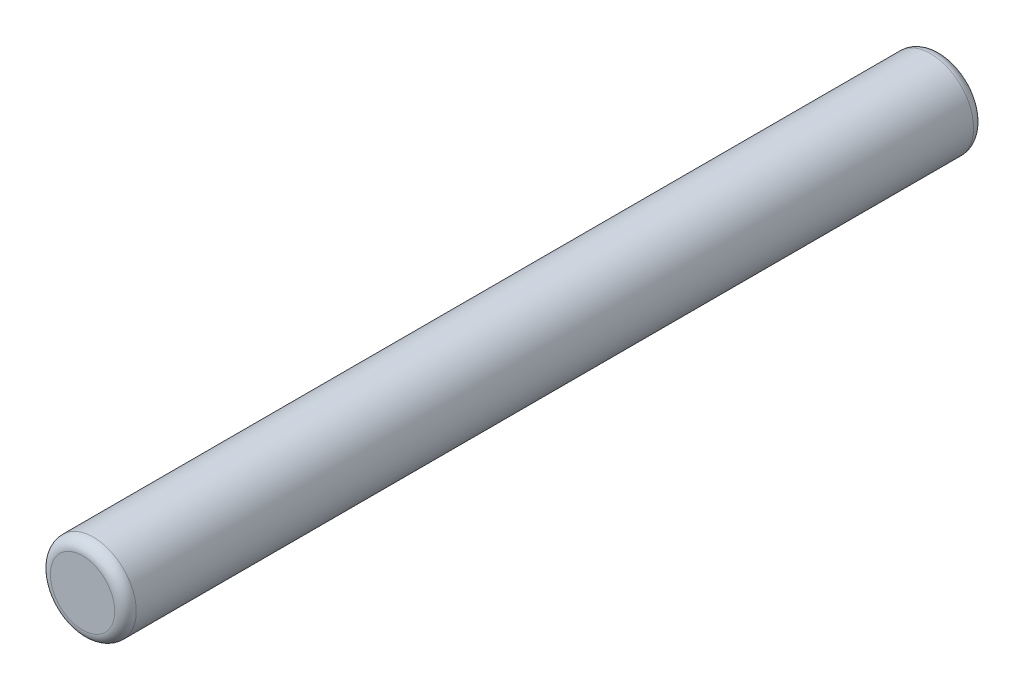
ISO-10303-21;
HEADER;
FILE_DESCRIPTION(('STEP AP214'),'2;1');
FILE_NAME('part.step','',(''),(''),'','','');
FILE_SCHEMA(('AUTOMOTIVE_DESIGN { 1 0 10303 214 1 1 1 1 }'));
ENDSEC;
DATA;
#1=APPLICATION_CONTEXT('core data for automotive mechanical design processes');
#2=APPLICATION_PROTOCOL_DEFINITION('international standard','automotive_design',2000,#1);
#3=PRODUCT_CONTEXT('',#1,'mechanical');
#4=PRODUCT('Part','Part','',(#3));
#5=PRODUCT_RELATED_PRODUCT_CATEGORY('part','',(#4));
#6=PRODUCT_DEFINITION_FORMATION('','',#4);
#7=PRODUCT_DEFINITION_CONTEXT('part definition',#1,'design');
#8=PRODUCT_DEFINITION('design','',#6,#7);
#9=PRODUCT_DEFINITION_SHAPE('','',#8);
#10=(LENGTH_UNIT() NAMED_UNIT(*) SI_UNIT(.MILLI.,.METRE.));
#11=(NAMED_UNIT(*) PLANE_ANGLE_UNIT() SI_UNIT($,.RADIAN.));
#12=(NAMED_UNIT(*) SI_UNIT($,.STERADIAN.) SOLID_ANGLE_UNIT());
#13=UNCERTAINTY_MEASURE_WITH_UNIT(LENGTH_MEASURE(1.E-05),#10,'distance_accuracy_value','');
#14=(GEOMETRIC_REPRESENTATION_CONTEXT(3) GLOBAL_UNCERTAINTY_ASSIGNED_CONTEXT((#13)) GLOBAL_UNIT_ASSIGNED_CONTEXT((#10,
#11,#12)) REPRESENTATION_CONTEXT('',''));
#15=CARTESIAN_POINT('',(0.,0.,0.));
#16=DIRECTION('',(0.,0.,1.));
#17=DIRECTION('',(1.,0.,0.));
#18=AXIS2_PLACEMENT_3D('',#15,#16,#17);
#19=CARTESIAN_POINT('',(0.,0.,40.));
#20=DIRECTION('',(0.,0.,-1.));
#21=DIRECTION('',(-1.,0.,0.));
#22=AXIS2_PLACEMENT_3D('',#19,#20,#21);
#23=CYLINDRICAL_SURFACE('',#22,2.);
#24=CARTESIAN_POINT('',(0.,0.,39.5));
#25=DIRECTION('',(0.,0.,1.));
#26=DIRECTION('',(1.,0.,0.));
#27=AXIS2_PLACEMENT_3D('',#24,#25,#26);
#28=CIRCLE('',#27,2.);
#29=CARTESIAN_POINT('',(2.,0.,39.5));
#30=VERTEX_POINT('',#29);
#31=EDGE_CURVE('E37',#30,#30,#28,.F.);
#32=ORIENTED_EDGE('',*,*,#31,.T.);
#33=EDGE_LOOP('',(#32));
#34=FACE_BOUND('',#33,.T.);
#35=CARTESIAN_POINT('',(0.,0.,0.5));
#36=DIRECTION('',(0.,0.,1.));
#37=DIRECTION('',(1.,0.,0.));
#38=AXIS2_PLACEMENT_3D('',#35,#36,#37);
#39=CIRCLE('',#38,2.);
#40=CARTESIAN_POINT('',(2.,0.,0.5));
#41=VERTEX_POINT('',#40);
#42=EDGE_CURVE('E41',#41,#41,#39,.T.);
#43=ORIENTED_EDGE('',*,*,#42,.T.);
#44=EDGE_LOOP('',(#43));
#45=FACE_BOUND('',#44,.T.);
#46=ADVANCED_FACE('F30',(#34,#45),#23,.T.);
#47=CARTESIAN_POINT('',(0.,0.,40.));
#48=DIRECTION('',(0.,0.,1.));
#49=DIRECTION('',(1.,0.,0.));
#50=AXIS2_PLACEMENT_3D('',#47,#48,#49);
#51=PLANE('',#50);
#52=CARTESIAN_POINT('',(0.,0.,40.));
#53=DIRECTION('',(0.,0.,1.));
#54=DIRECTION('',(1.,0.,0.));
#55=AXIS2_PLACEMENT_3D('',#52,#53,#54);
#56=CIRCLE('',#55,1.5);
#57=CARTESIAN_POINT('',(1.5,0.,40.));
#58=VERTEX_POINT('',#57);
#59=EDGE_CURVE('E45',#58,#58,#56,.T.);
#60=ORIENTED_EDGE('',*,*,#59,.T.);
#61=EDGE_LOOP('',(#60));
#62=FACE_BOUND('',#61,.T.);
#63=ADVANCED_FACE('F51',(#62),#51,.T.);
#64=CARTESIAN_POINT('',(0.,0.,0.));
#65=DIRECTION('',(0.,0.,1.));
#66=DIRECTION('',(1.,0.,0.));
#67=AXIS2_PLACEMENT_3D('',#64,#65,#66);
#68=PLANE('',#67);
#69=CARTESIAN_POINT('',(0.,0.,0.));
#70=DIRECTION('',(0.,0.,1.));
#71=DIRECTION('',(1.,0.,0.));
#72=AXIS2_PLACEMENT_3D('',#69,#70,#71);
#73=CIRCLE('',#72,1.5);
#74=CARTESIAN_POINT('',(1.5,0.,0.));
#75=VERTEX_POINT('',#74);
#76=EDGE_CURVE('E10',#75,#75,#73,.F.);
#77=ORIENTED_EDGE('',*,*,#76,.T.);
#78=EDGE_LOOP('',(#77));
#79=FACE_BOUND('',#78,.T.);
#80=ADVANCED_FACE('F55',(#79),#68,.F.);
#81=CARTESIAN_POINT('',(0.,0.,39.5));
#82=DIRECTION('',(0.,0.,1.));
#83=DIRECTION('',(1.,0.,0.));
#84=AXIS2_PLACEMENT_3D('',#81,#82,#83);
#85=TOROIDAL_SURFACE('',#84,1.5,0.5);
#86=ORIENTED_EDGE('',*,*,#31,.F.);
#87=EDGE_LOOP('',(#86));
#88=FACE_BOUND('',#87,.T.);
#89=ORIENTED_EDGE('',*,*,#59,.F.);
#90=EDGE_LOOP('',(#89));
#91=FACE_BOUND('',#90,.T.);
#92=ADVANCED_FACE('F53',(#88,#91),#85,.T.);
#93=CARTESIAN_POINT('',(0.,0.,0.5));
#94=DIRECTION('',(0.,0.,1.));
#95=DIRECTION('',(1.,0.,0.));
#96=AXIS2_PLACEMENT_3D('',#93,#94,#95);
#97=TOROIDAL_SURFACE('',#96,1.5,0.5);
#98=ORIENTED_EDGE('',*,*,#76,.F.);
#99=EDGE_LOOP('',(#98));
#100=FACE_BOUND('',#99,.T.);
#101=ORIENTED_EDGE('',*,*,#42,.F.);
#102=EDGE_LOOP('',(#101));
#103=FACE_BOUND('',#102,.T.);
#104=ADVANCED_FACE('F32',(#100,#103),#97,.T.);
#105=CLOSED_SHELL('',(#46,#63,#80,#92,#104));
#106=MANIFOLD_SOLID_BREP('B2',#105);
#107=ADVANCED_BREP_SHAPE_REPRESENTATION('',(#18,#106),#14);
#108=SHAPE_DEFINITION_REPRESENTATION(#9,#107);
ENDSEC;
END-ISO-10303-21;
